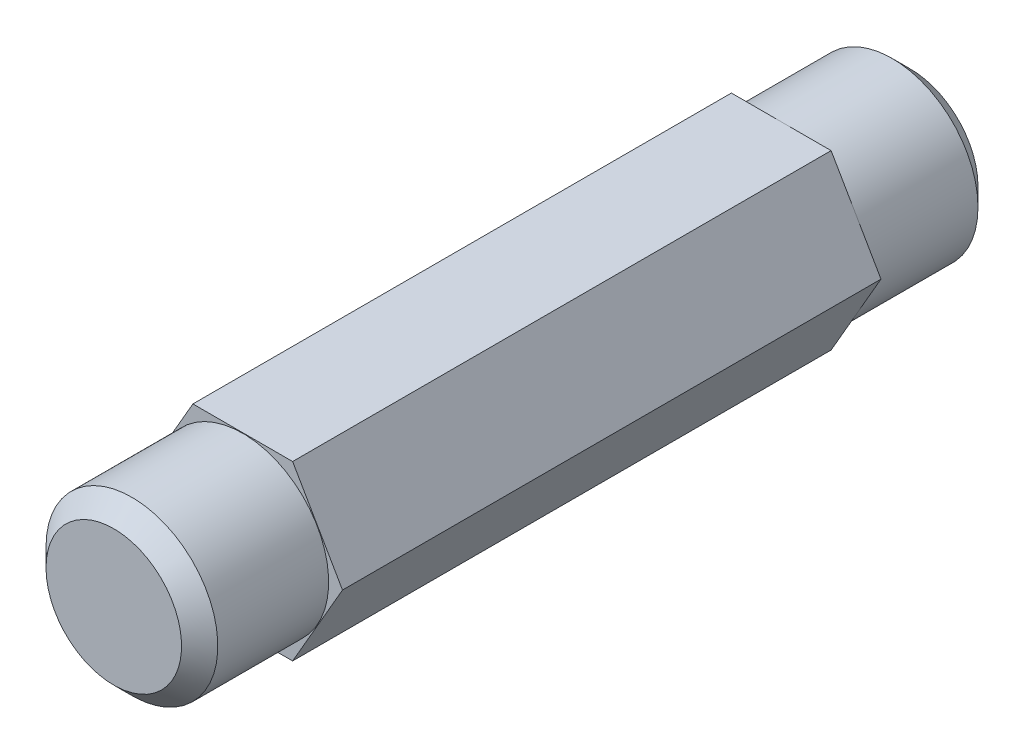
ISO-10303-21;
HEADER;
FILE_DESCRIPTION(('STEP AP214'),'2;1');
FILE_NAME('part.step','',(''),(''),'','','');
FILE_SCHEMA(('AUTOMOTIVE_DESIGN { 1 0 10303 214 1 1 1 1 }'));
ENDSEC;
DATA;
#1=APPLICATION_CONTEXT('core data for automotive mechanical design processes');
#2=APPLICATION_PROTOCOL_DEFINITION('international standard','automotive_design',2000,#1);
#3=PRODUCT_CONTEXT('',#1,'mechanical');
#4=PRODUCT('Part','Part','',(#3));
#5=PRODUCT_RELATED_PRODUCT_CATEGORY('part','',(#4));
#6=PRODUCT_DEFINITION_FORMATION('','',#4);
#7=PRODUCT_DEFINITION_CONTEXT('part definition',#1,'design');
#8=PRODUCT_DEFINITION('design','',#6,#7);
#9=PRODUCT_DEFINITION_SHAPE('','',#8);
#10=(LENGTH_UNIT() NAMED_UNIT(*) SI_UNIT(.MILLI.,.METRE.));
#11=(NAMED_UNIT(*) PLANE_ANGLE_UNIT() SI_UNIT($,.RADIAN.));
#12=(NAMED_UNIT(*) SI_UNIT($,.STERADIAN.) SOLID_ANGLE_UNIT());
#13=UNCERTAINTY_MEASURE_WITH_UNIT(LENGTH_MEASURE(1.E-05),#10,'distance_accuracy_value','');
#14=(GEOMETRIC_REPRESENTATION_CONTEXT(3) GLOBAL_UNCERTAINTY_ASSIGNED_CONTEXT((#13)) GLOBAL_UNIT_ASSIGNED_CONTEXT((#10,
#11,#12)) REPRESENTATION_CONTEXT('',''));
#15=CARTESIAN_POINT('',(0.,0.,0.));
#16=DIRECTION('',(0.,0.,1.));
#17=DIRECTION('',(1.,0.,0.));
#18=AXIS2_PLACEMENT_3D('',#15,#16,#17);
#19=CARTESIAN_POINT('',(0.,0.,21.9583));
#20=DIRECTION('',(0.,0.,1.));
#21=DIRECTION('',(1.,0.,0.));
#22=AXIS2_PLACEMENT_3D('',#19,#20,#21);
#23=PLANE('',#22);
#24=CARTESIAN_POINT('',(0.,0.,21.9582999999943));
#25=DIRECTION('',(0.,0.,-1.));
#26=DIRECTION('',(-1.,0.,0.));
#27=AXIS2_PLACEMENT_3D('',#24,#25,#26);
#28=CIRCLE('',#27,3.73710000002347);
#29=CARTESIAN_POINT('',(-3.73710000002347,0.,21.9582999999943));
#30=VERTEX_POINT('',#29);
#31=EDGE_CURVE('E20',#30,#30,#28,.T.);
#32=ORIENTED_EDGE('',*,*,#31,.F.);
#33=EDGE_LOOP('',(#32));
#34=FACE_BOUND('',#33,.T.);
#35=ADVANCED_FACE('F17',(#34),#23,.T.);
#36=CARTESIAN_POINT('',(0.,0.,-21.9583));
#37=DIRECTION('',(0.,0.,-1.));
#38=DIRECTION('',(-1.,0.,0.));
#39=AXIS2_PLACEMENT_3D('',#36,#37,#38);
#40=PLANE('',#39);
#41=CARTESIAN_POINT('',(0.,0.,-21.9583000000512));
#42=DIRECTION('',(0.,0.,1.));
#43=DIRECTION('',(1.,0.,0.));
#44=AXIS2_PLACEMENT_3D('',#41,#42,#43);
#45=CIRCLE('',#44,3.73709999996663);
#46=CARTESIAN_POINT('',(3.73709999996663,0.,-21.9583000000512));
#47=VERTEX_POINT('',#46);
#48=EDGE_CURVE('E106',#47,#47,#45,.T.);
#49=ORIENTED_EDGE('',*,*,#48,.F.);
#50=EDGE_LOOP('',(#49));
#51=FACE_BOUND('',#50,.T.);
#52=ADVANCED_FACE('F124',(#51),#40,.T.);
#53=CARTESIAN_POINT('',(0.,0.,20.9582999999043));
#54=DIRECTION('',(0.,0.,-1.));
#55=DIRECTION('',(-1.,0.,0.));
#56=AXIS2_PLACEMENT_3D('',#53,#54,#55);
#57=CONICAL_SURFACE('',#56,4.73710000011351,0.785398163397448);
#58=CARTESIAN_POINT('',(0.,0.,20.9583));
#59=DIRECTION('',(0.,0.,-1.));
#60=DIRECTION('',(-1.,0.,0.));
#61=AXIS2_PLACEMENT_3D('',#58,#59,#60);
#62=CIRCLE('',#61,4.7371);
#63=CARTESIAN_POINT('',(-4.7371,0.,20.9583));
#64=VERTEX_POINT('',#63);
#65=EDGE_CURVE('E103',#64,#64,#62,.T.);
#66=ORIENTED_EDGE('',*,*,#65,.F.);
#67=EDGE_LOOP('',(#66));
#68=FACE_BOUND('',#67,.T.);
#69=ORIENTED_EDGE('',*,*,#31,.T.);
#70=EDGE_LOOP('',(#69));
#71=FACE_BOUND('',#70,.T.);
#72=ADVANCED_FACE('F121',(#68,#71),#57,.T.);
#73=CARTESIAN_POINT('',(0.,0.,-20.958300000018));
#74=DIRECTION('',(0.,0.,1.));
#75=DIRECTION('',(1.,0.,0.));
#76=AXIS2_PLACEMENT_3D('',#73,#74,#75);
#77=CONICAL_SURFACE('',#76,4.73709999994298,0.785398163369027);
#78=CARTESIAN_POINT('',(0.,0.,-20.9583));
#79=DIRECTION('',(0.,0.,1.));
#80=DIRECTION('',(1.,0.,0.));
#81=AXIS2_PLACEMENT_3D('',#78,#79,#80);
#82=CIRCLE('',#81,4.7371);
#83=CARTESIAN_POINT('',(4.7371,0.,-20.9583));
#84=VERTEX_POINT('',#83);
#85=EDGE_CURVE('E100',#84,#84,#82,.T.);
#86=ORIENTED_EDGE('',*,*,#85,.F.);
#87=EDGE_LOOP('',(#86));
#88=FACE_BOUND('',#87,.T.);
#89=ORIENTED_EDGE('',*,*,#48,.T.);
#90=EDGE_LOOP('',(#89));
#91=FACE_BOUND('',#90,.T.);
#92=ADVANCED_FACE('F166',(#88,#91),#77,.T.);
#93=CARTESIAN_POINT('',(0.,0.,21.9583));
#94=DIRECTION('',(0.,0.,-1.));
#95=DIRECTION('',(-1.,0.,0.));
#96=AXIS2_PLACEMENT_3D('',#93,#94,#95);
#97=CYLINDRICAL_SURFACE('',#96,4.7371);
#98=CARTESIAN_POINT('',(0.,0.,14.8463));
#99=DIRECTION('',(0.,0.,-1.));
#100=DIRECTION('',(-1.,0.,0.));
#101=AXIS2_PLACEMENT_3D('',#98,#99,#100);
#102=CIRCLE('',#101,4.7371);
#103=CARTESIAN_POINT('',(-4.7371,0.,14.8463));
#104=VERTEX_POINT('',#103);
#105=EDGE_CURVE('E112',#104,#104,#102,.T.);
#106=ORIENTED_EDGE('',*,*,#105,.F.);
#107=EDGE_LOOP('',(#106));
#108=FACE_BOUND('',#107,.T.);
#109=ORIENTED_EDGE('',*,*,#65,.T.);
#110=EDGE_LOOP('',(#109));
#111=FACE_BOUND('',#110,.T.);
#112=ADVANCED_FACE('F162',(#108,#111),#97,.T.);
#113=CARTESIAN_POINT('',(0.,0.,-21.9583));
#114=DIRECTION('',(0.,0.,1.));
#115=DIRECTION('',(1.,0.,0.));
#116=AXIS2_PLACEMENT_3D('',#113,#114,#115);
#117=CYLINDRICAL_SURFACE('',#116,4.7371);
#118=CARTESIAN_POINT('',(0.,0.,-14.8463));
#119=DIRECTION('',(0.,0.,1.));
#120=DIRECTION('',(1.,0.,0.));
#121=AXIS2_PLACEMENT_3D('',#118,#119,#120);
#122=CIRCLE('',#121,4.7371);
#123=CARTESIAN_POINT('',(4.7371,0.,-14.8463));
#124=VERTEX_POINT('',#123);
#125=EDGE_CURVE('E107',#124,#124,#122,.F.);
#126=ORIENTED_EDGE('',*,*,#125,.T.);
#127=EDGE_LOOP('',(#126));
#128=FACE_BOUND('',#127,.T.);
#129=ORIENTED_EDGE('',*,*,#85,.T.);
#130=EDGE_LOOP('',(#129));
#131=FACE_BOUND('',#130,.T.);
#132=ADVANCED_FACE('F159',(#128,#131),#117,.T.);
#133=CARTESIAN_POINT('',(5.49926131403118,0.,14.8463));
#134=DIRECTION('',(-0.866025403784439,-0.5,0.));
#135=DIRECTION('',(0.5,-0.866025403784439,0.));
#136=AXIS2_PLACEMENT_3D('',#133,#134,#135);
#137=PLANE('',#136);
#138=DIRECTION('',(0.,0.,-1.));
#139=VECTOR('',#138,1.);
#140=CARTESIAN_POINT('',(2.74963065701559,4.7625,14.8463));
#141=LINE('',#140,#139);
#142=CARTESIAN_POINT('',(2.74963065701559,4.7625,-14.8463));
#143=VERTEX_POINT('',#142);
#144=CARTESIAN_POINT('',(2.74963065701559,4.7625,14.8463));
#145=VERTEX_POINT('',#144);
#146=EDGE_CURVE('E82',#143,#145,#141,.F.);
#147=ORIENTED_EDGE('',*,*,#146,.T.);
#148=DIRECTION('',(-0.5,0.866025403784439,0.));
#149=VECTOR('',#148,1.);
#150=CARTESIAN_POINT('',(5.49926131403118,0.,14.8463));
#151=LINE('',#150,#149);
#152=CARTESIAN_POINT('',(5.49926131403118,0.,14.8463));
#153=VERTEX_POINT('',#152);
#154=EDGE_CURVE('E87',#153,#145,#151,.T.);
#155=ORIENTED_EDGE('',*,*,#154,.F.);
#156=DIRECTION('',(0.,0.,1.));
#157=VECTOR('',#156,1.);
#158=CARTESIAN_POINT('',(5.49926131403118,0.,14.8463));
#159=LINE('',#158,#157);
#160=CARTESIAN_POINT('',(5.49926131403118,0.,-14.8463));
#161=VERTEX_POINT('',#160);
#162=EDGE_CURVE('E73',#153,#161,#159,.F.);
#163=ORIENTED_EDGE('',*,*,#162,.T.);
#164=DIRECTION('',(-0.5,0.866025403784439,0.));
#165=VECTOR('',#164,1.);
#166=CARTESIAN_POINT('',(5.49926131403118,0.,-14.8463));
#167=LINE('',#166,#165);
#168=EDGE_CURVE('E110',#161,#143,#167,.T.);
#169=ORIENTED_EDGE('',*,*,#168,.T.);
#170=EDGE_LOOP('',(#147,#155,#163,#169));
#171=FACE_BOUND('',#170,.T.);
#172=ADVANCED_FACE('F91',(#171),#137,.F.);
#173=CARTESIAN_POINT('',(-2.74963065701559,-4.7625,14.8463));
#174=DIRECTION('',(0.,1.,0.));
#175=DIRECTION('',(0.,0.,1.));
#176=AXIS2_PLACEMENT_3D('',#173,#174,#175);
#177=PLANE('',#176);
#178=DIRECTION('',(0.,0.,1.));
#179=VECTOR('',#178,1.);
#180=CARTESIAN_POINT('',(2.74963065701559,-4.7625,14.8463));
#181=LINE('',#180,#179);
#182=CARTESIAN_POINT('',(2.74963065701559,-4.7625,-14.8463));
#183=VERTEX_POINT('',#182);
#184=CARTESIAN_POINT('',(2.74963065701559,-4.7625,14.8463));
#185=VERTEX_POINT('',#184);
#186=EDGE_CURVE('E66',#183,#185,#181,.T.);
#187=ORIENTED_EDGE('',*,*,#186,.T.);
#188=DIRECTION('',(1.,0.,0.));
#189=VECTOR('',#188,1.);
#190=CARTESIAN_POINT('',(5.49926131403118,-4.7625,14.8463));
#191=LINE('',#190,#189);
#192=CARTESIAN_POINT('',(-2.74963065701559,-4.7625,14.8463));
#193=VERTEX_POINT('',#192);
#194=EDGE_CURVE('E89',#193,#185,#191,.T.);
#195=ORIENTED_EDGE('',*,*,#194,.F.);
#196=DIRECTION('',(0.,0.,1.));
#197=VECTOR('',#196,1.);
#198=CARTESIAN_POINT('',(-2.74963065701559,-4.7625,14.8463));
#199=LINE('',#198,#197);
#200=CARTESIAN_POINT('',(-2.74963065701559,-4.7625,-14.8463));
#201=VERTEX_POINT('',#200);
#202=EDGE_CURVE('E111',#193,#201,#199,.F.);
#203=ORIENTED_EDGE('',*,*,#202,.T.);
#204=DIRECTION('',(1.,0.,0.));
#205=VECTOR('',#204,1.);
#206=CARTESIAN_POINT('',(5.49926131403118,-4.7625,-14.8463));
#207=LINE('',#206,#205);
#208=EDGE_CURVE('E308',#201,#183,#207,.T.);
#209=ORIENTED_EDGE('',*,*,#208,.T.);
#210=EDGE_LOOP('',(#187,#195,#203,#209));
#211=FACE_BOUND('',#210,.T.);
#212=ADVANCED_FACE('F154',(#211),#177,.F.);
#213=CARTESIAN_POINT('',(2.74963065701559,-4.7625,14.8463));
#214=DIRECTION('',(-0.866025403784439,0.5,0.));
#215=DIRECTION('',(-0.5,-0.866025403784439,0.));
#216=AXIS2_PLACEMENT_3D('',#213,#214,#215);
#217=PLANE('',#216);
#218=ORIENTED_EDGE('',*,*,#162,.F.);
#219=DIRECTION('',(0.5,0.866025403784439,0.));
#220=VECTOR('',#219,1.);
#221=CARTESIAN_POINT('',(2.74963065701559,-4.7625,14.8463));
#222=LINE('',#221,#220);
#223=EDGE_CURVE('E76',#185,#153,#222,.T.);
#224=ORIENTED_EDGE('',*,*,#223,.F.);
#225=ORIENTED_EDGE('',*,*,#186,.F.);
#226=DIRECTION('',(0.5,0.866025403784439,0.));
#227=VECTOR('',#226,1.);
#228=CARTESIAN_POINT('',(2.74963065701559,-4.7625,-14.8463));
#229=LINE('',#228,#227);
#230=EDGE_CURVE('E78',#183,#161,#229,.T.);
#231=ORIENTED_EDGE('',*,*,#230,.T.);
#232=EDGE_LOOP('',(#218,#224,#225,#231));
#233=FACE_BOUND('',#232,.T.);
#234=ADVANCED_FACE('F75',(#233),#217,.F.);
#235=CARTESIAN_POINT('',(2.74963065701559,4.7625,14.8463));
#236=DIRECTION('',(0.,-1.,0.));
#237=DIRECTION('',(0.,0.,-1.));
#238=AXIS2_PLACEMENT_3D('',#235,#236,#237);
#239=PLANE('',#238);
#240=DIRECTION('',(0.,0.,1.));
#241=VECTOR('',#240,1.);
#242=CARTESIAN_POINT('',(-2.74963065701559,4.7625,14.8463));
#243=LINE('',#242,#241);
#244=CARTESIAN_POINT('',(-2.74963065701559,4.7625,-14.8463));
#245=VERTEX_POINT('',#244);
#246=CARTESIAN_POINT('',(-2.74963065701559,4.7625,14.8463));
#247=VERTEX_POINT('',#246);
#248=EDGE_CURVE('E300',#245,#247,#243,.T.);
#249=ORIENTED_EDGE('',*,*,#248,.T.);
#250=DIRECTION('',(1.,0.,0.));
#251=VECTOR('',#250,1.);
#252=CARTESIAN_POINT('',(5.49926131403118,4.7625,14.8463));
#253=LINE('',#252,#251);
#254=EDGE_CURVE('E93',#145,#247,#253,.F.);
#255=ORIENTED_EDGE('',*,*,#254,.F.);
#256=ORIENTED_EDGE('',*,*,#146,.F.);
#257=DIRECTION('',(1.,0.,0.));
#258=VECTOR('',#257,1.);
#259=CARTESIAN_POINT('',(5.49926131403118,4.7625,-14.8463));
#260=LINE('',#259,#258);
#261=EDGE_CURVE('E302',#143,#245,#260,.F.);
#262=ORIENTED_EDGE('',*,*,#261,.T.);
#263=EDGE_LOOP('',(#249,#255,#256,#262));
#264=FACE_BOUND('',#263,.T.);
#265=ADVANCED_FACE('F147',(#264),#239,.F.);
#266=CARTESIAN_POINT('',(5.49926131403118,0.,14.8463));
#267=DIRECTION('',(0.,0.,1.));
#268=DIRECTION('',(1.,0.,0.));
#269=AXIS2_PLACEMENT_3D('',#266,#267,#268);
#270=PLANE('',#269);
#271=ORIENTED_EDGE('',*,*,#105,.T.);
#272=EDGE_LOOP('',(#271));
#273=FACE_BOUND('',#272,.T.);
#274=DIRECTION('',(-0.5,0.866025403784439,0.));
#275=VECTOR('',#274,1.);
#276=CARTESIAN_POINT('',(-5.49926131403119,0.,14.8463));
#277=LINE('',#276,#275);
#278=CARTESIAN_POINT('',(-5.49926131403119,0.,14.8463));
#279=VERTEX_POINT('',#278);
#280=EDGE_CURVE('E114',#279,#193,#277,.F.);
#281=ORIENTED_EDGE('',*,*,#280,.T.);
#282=ORIENTED_EDGE('',*,*,#194,.T.);
#283=ORIENTED_EDGE('',*,*,#223,.T.);
#284=ORIENTED_EDGE('',*,*,#154,.T.);
#285=ORIENTED_EDGE('',*,*,#254,.T.);
#286=DIRECTION('',(0.5,0.866025403784439,0.));
#287=VECTOR('',#286,1.);
#288=CARTESIAN_POINT('',(-2.74963065701559,4.7625,14.8463));
#289=LINE('',#288,#287);
#290=EDGE_CURVE('E304',#247,#279,#289,.F.);
#291=ORIENTED_EDGE('',*,*,#290,.T.);
#292=EDGE_LOOP('',(#281,#282,#283,#284,#285,#291));
#293=FACE_BOUND('',#292,.T.);
#294=ADVANCED_FACE('F86',(#273,#293),#270,.T.);
#295=CARTESIAN_POINT('',(-5.49926131403119,0.,14.8463));
#296=DIRECTION('',(0.866025403784439,0.5,0.));
#297=DIRECTION('',(-0.5,0.866025403784439,0.));
#298=AXIS2_PLACEMENT_3D('',#295,#296,#297);
#299=PLANE('',#298);
#300=ORIENTED_EDGE('',*,*,#202,.F.);
#301=ORIENTED_EDGE('',*,*,#280,.F.);
#302=DIRECTION('',(0.,0.,1.));
#303=VECTOR('',#302,1.);
#304=CARTESIAN_POINT('',(-5.49926131403119,0.,14.8463));
#305=LINE('',#304,#303);
#306=CARTESIAN_POINT('',(-5.49926131403119,0.,-14.8463));
#307=VERTEX_POINT('',#306);
#308=EDGE_CURVE('E26',#279,#307,#305,.F.);
#309=ORIENTED_EDGE('',*,*,#308,.T.);
#310=DIRECTION('',(0.5,-0.866025403784439,0.));
#311=VECTOR('',#310,1.);
#312=CARTESIAN_POINT('',(-5.49926131403119,0.,-14.8463));
#313=LINE('',#312,#311);
#314=EDGE_CURVE('E34',#307,#201,#313,.T.);
#315=ORIENTED_EDGE('',*,*,#314,.T.);
#316=EDGE_LOOP('',(#300,#301,#309,#315));
#317=FACE_BOUND('',#316,.T.);
#318=ADVANCED_FACE('F138',(#317),#299,.F.);
#319=CARTESIAN_POINT('',(5.49926131403118,0.,-14.8463));
#320=DIRECTION('',(0.,0.,1.));
#321=DIRECTION('',(1.,0.,0.));
#322=AXIS2_PLACEMENT_3D('',#319,#320,#321);
#323=PLANE('',#322);
#324=ORIENTED_EDGE('',*,*,#208,.F.);
#325=ORIENTED_EDGE('',*,*,#314,.F.);
#326=DIRECTION('',(0.5,0.866025403784439,0.));
#327=VECTOR('',#326,1.);
#328=CARTESIAN_POINT('',(-2.74963065701559,4.7625,-14.8463));
#329=LINE('',#328,#327);
#330=EDGE_CURVE('E11',#307,#245,#329,.T.);
#331=ORIENTED_EDGE('',*,*,#330,.T.);
#332=ORIENTED_EDGE('',*,*,#261,.F.);
#333=ORIENTED_EDGE('',*,*,#168,.F.);
#334=ORIENTED_EDGE('',*,*,#230,.F.);
#335=EDGE_LOOP('',(#324,#325,#331,#332,#333,#334));
#336=FACE_BOUND('',#335,.T.);
#337=ORIENTED_EDGE('',*,*,#125,.F.);
#338=EDGE_LOOP('',(#337));
#339=FACE_BOUND('',#338,.T.);
#340=ADVANCED_FACE('F132',(#336,#339),#323,.F.);
#341=CARTESIAN_POINT('',(-2.74963065701559,4.7625,14.8463));
#342=DIRECTION('',(0.866025403784439,-0.5,0.));
#343=DIRECTION('',(0.5,0.866025403784439,0.));
#344=AXIS2_PLACEMENT_3D('',#341,#342,#343);
#345=PLANE('',#344);
#346=ORIENTED_EDGE('',*,*,#308,.F.);
#347=ORIENTED_EDGE('',*,*,#290,.F.);
#348=ORIENTED_EDGE('',*,*,#248,.F.);
#349=ORIENTED_EDGE('',*,*,#330,.F.);
#350=EDGE_LOOP('',(#346,#347,#348,#349));
#351=FACE_BOUND('',#350,.T.);
#352=ADVANCED_FACE('F130',(#351),#345,.F.);
#353=CLOSED_SHELL('',(#35,#52,#72,#92,#112,#132,#172,#212,#234,#265,#294,#318,#340,#352));
#354=MANIFOLD_SOLID_BREP('B1',#353);
#355=ADVANCED_BREP_SHAPE_REPRESENTATION('',(#18,#354),#14);
#356=SHAPE_DEFINITION_REPRESENTATION(#9,#355);
ENDSEC;
END-ISO-10303-21;
